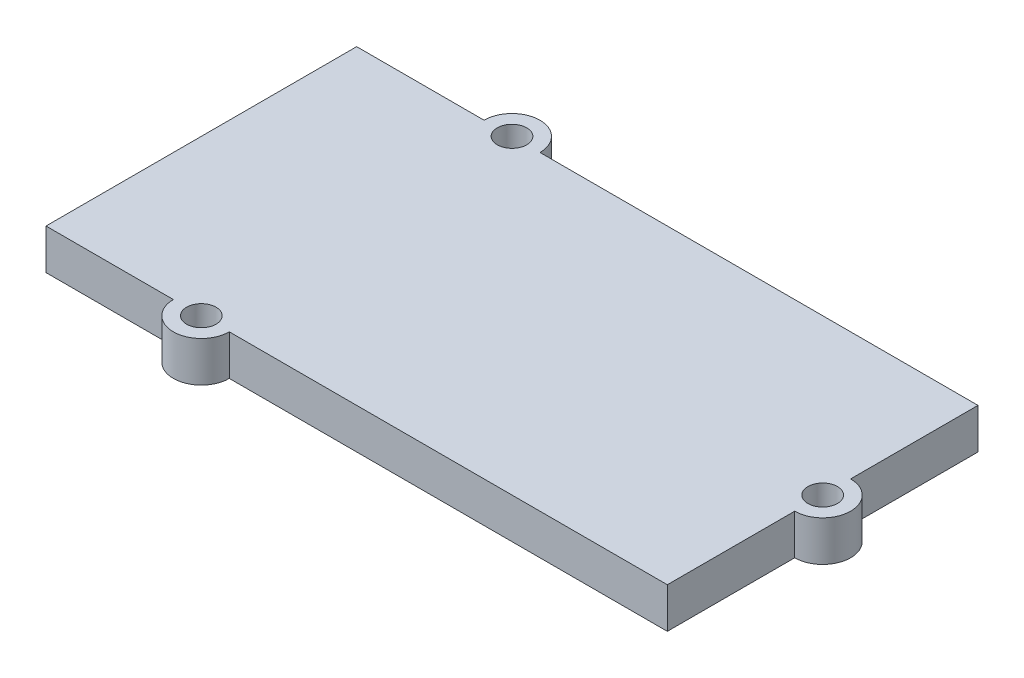
ISO-10303-21;
HEADER;
FILE_DESCRIPTION(('STEP AP214'),'2;1');
FILE_NAME('part.step','',(''),(''),'','','');
FILE_SCHEMA(('AUTOMOTIVE_DESIGN { 1 0 10303 214 1 1 1 1 }'));
ENDSEC;
DATA;
#1=APPLICATION_CONTEXT('core data for automotive mechanical design processes');
#2=APPLICATION_PROTOCOL_DEFINITION('international standard','automotive_design',2000,#1);
#3=PRODUCT_CONTEXT('',#1,'mechanical');
#4=PRODUCT('Part','Part','',(#3));
#5=PRODUCT_RELATED_PRODUCT_CATEGORY('part','',(#4));
#6=PRODUCT_DEFINITION_FORMATION('','',#4);
#7=PRODUCT_DEFINITION_CONTEXT('part definition',#1,'design');
#8=PRODUCT_DEFINITION('design','',#6,#7);
#9=PRODUCT_DEFINITION_SHAPE('','',#8);
#10=(LENGTH_UNIT() NAMED_UNIT(*) SI_UNIT(.MILLI.,.METRE.));
#11=(NAMED_UNIT(*) PLANE_ANGLE_UNIT() SI_UNIT($,.RADIAN.));
#12=(NAMED_UNIT(*) SI_UNIT($,.STERADIAN.) SOLID_ANGLE_UNIT());
#13=UNCERTAINTY_MEASURE_WITH_UNIT(LENGTH_MEASURE(1.E-05),#10,'distance_accuracy_value','');
#14=(GEOMETRIC_REPRESENTATION_CONTEXT(3) GLOBAL_UNCERTAINTY_ASSIGNED_CONTEXT((#13)) GLOBAL_UNIT_ASSIGNED_CONTEXT((#10,
#11,#12)) REPRESENTATION_CONTEXT('',''));
#15=CARTESIAN_POINT('',(0.,0.,0.));
#16=DIRECTION('',(0.,0.,1.));
#17=DIRECTION('',(1.,0.,0.));
#18=AXIS2_PLACEMENT_3D('',#15,#16,#17);
#19=CARTESIAN_POINT('',(-10.,2.6,0.));
#20=DIRECTION('',(0.,-1.,0.));
#21=DIRECTION('',(0.,0.,-1.));
#22=AXIS2_PLACEMENT_3D('',#19,#20,#21);
#23=CYLINDRICAL_SURFACE('',#22,1.8);
#24=CARTESIAN_POINT('',(-10.,0.,0.));
#25=DIRECTION('',(0.,1.,0.));
#26=DIRECTION('',(0.,0.,1.));
#27=AXIS2_PLACEMENT_3D('',#24,#25,#26);
#28=CIRCLE('',#27,1.8);
#29=CARTESIAN_POINT('',(-8.2,0.,0.));
#30=VERTEX_POINT('',#29);
#31=CARTESIAN_POINT('',(-11.8,0.,0.));
#32=VERTEX_POINT('',#31);
#33=EDGE_CURVE('E170',#30,#32,#28,.T.);
#34=ORIENTED_EDGE('',*,*,#33,.T.);
#35=DIRECTION('',(0.,-1.,0.));
#36=VECTOR('',#35,1.);
#37=CARTESIAN_POINT('',(-11.8,2.6,0.));
#38=LINE('',#37,#36);
#39=CARTESIAN_POINT('',(-11.8,2.6,0.));
#40=VERTEX_POINT('',#39);
#41=EDGE_CURVE('E11',#40,#32,#38,.T.);
#42=ORIENTED_EDGE('',*,*,#41,.F.);
#43=CARTESIAN_POINT('',(-10.,2.6,0.));
#44=DIRECTION('',(0.,1.,0.));
#45=DIRECTION('',(0.,0.,1.));
#46=AXIS2_PLACEMENT_3D('',#43,#44,#45);
#47=CIRCLE('',#46,1.8);
#48=CARTESIAN_POINT('',(-8.2,2.6,0.));
#49=VERTEX_POINT('',#48);
#50=EDGE_CURVE('E211',#49,#40,#47,.T.);
#51=ORIENTED_EDGE('',*,*,#50,.F.);
#52=DIRECTION('',(0.,-1.,0.));
#53=VECTOR('',#52,1.);
#54=CARTESIAN_POINT('',(-8.2,2.6,0.));
#55=LINE('',#54,#53);
#56=EDGE_CURVE('E169',#49,#30,#55,.T.);
#57=ORIENTED_EDGE('',*,*,#56,.T.);
#58=EDGE_LOOP('',(#34,#42,#51,#57));
#59=FACE_BOUND('',#58,.T.);
#60=ADVANCED_FACE('F45',(#59),#23,.T.);
#61=CARTESIAN_POINT('',(0.,2.6,0.));
#62=DIRECTION('',(0.,0.,1.));
#63=DIRECTION('',(1.,0.,0.));
#64=AXIS2_PLACEMENT_3D('',#61,#62,#63);
#65=PLANE('',#64);
#66=DIRECTION('',(-1.,0.,0.));
#67=VECTOR('',#66,1.);
#68=CARTESIAN_POINT('',(0.,0.,0.));
#69=LINE('',#68,#67);
#70=CARTESIAN_POINT('',(-20.,0.,0.));
#71=VERTEX_POINT('',#70);
#72=EDGE_CURVE('E174',#32,#71,#69,.T.);
#73=ORIENTED_EDGE('',*,*,#72,.T.);
#74=DIRECTION('',(0.,-1.,0.));
#75=VECTOR('',#74,1.);
#76=CARTESIAN_POINT('',(-20.,2.6,0.));
#77=LINE('',#76,#75);
#78=CARTESIAN_POINT('',(-20.,2.6,0.));
#79=VERTEX_POINT('',#78);
#80=EDGE_CURVE('E54',#79,#71,#77,.T.);
#81=ORIENTED_EDGE('',*,*,#80,.F.);
#82=DIRECTION('',(-1.,0.,0.));
#83=VECTOR('',#82,1.);
#84=CARTESIAN_POINT('',(0.,2.6,0.));
#85=LINE('',#84,#83);
#86=EDGE_CURVE('E107',#40,#79,#85,.T.);
#87=ORIENTED_EDGE('',*,*,#86,.F.);
#88=ORIENTED_EDGE('',*,*,#41,.T.);
#89=EDGE_LOOP('',(#73,#81,#87,#88));
#90=FACE_BOUND('',#89,.T.);
#91=ADVANCED_FACE('F280',(#90),#65,.F.);
#92=CARTESIAN_POINT('',(-20.,2.6,0.));
#93=DIRECTION('',(1.,0.,0.));
#94=DIRECTION('',(0.,0.,-1.));
#95=AXIS2_PLACEMENT_3D('',#92,#93,#94);
#96=PLANE('',#95);
#97=DIRECTION('',(0.,0.,1.));
#98=VECTOR('',#97,1.);
#99=CARTESIAN_POINT('',(-20.,0.,0.));
#100=LINE('',#99,#98);
#101=CARTESIAN_POINT('',(-20.,0.,20.));
#102=VERTEX_POINT('',#101);
#103=EDGE_CURVE('E177',#71,#102,#100,.T.);
#104=ORIENTED_EDGE('',*,*,#103,.T.);
#105=DIRECTION('',(0.,-1.,0.));
#106=VECTOR('',#105,1.);
#107=CARTESIAN_POINT('',(-20.,2.6,20.));
#108=LINE('',#107,#106);
#109=CARTESIAN_POINT('',(-20.,2.6,20.));
#110=VERTEX_POINT('',#109);
#111=EDGE_CURVE('E227',#110,#102,#108,.T.);
#112=ORIENTED_EDGE('',*,*,#111,.F.);
#113=DIRECTION('',(0.,0.,1.));
#114=VECTOR('',#113,1.);
#115=CARTESIAN_POINT('',(-20.,2.6,0.));
#116=LINE('',#115,#114);
#117=EDGE_CURVE('E236',#79,#110,#116,.T.);
#118=ORIENTED_EDGE('',*,*,#117,.F.);
#119=ORIENTED_EDGE('',*,*,#80,.T.);
#120=EDGE_LOOP('',(#104,#112,#118,#119));
#121=FACE_BOUND('',#120,.T.);
#122=ADVANCED_FACE('F234',(#121),#96,.F.);
#123=CARTESIAN_POINT('',(0.,2.6,20.));
#124=DIRECTION('',(0.,0.,1.));
#125=DIRECTION('',(1.,0.,0.));
#126=AXIS2_PLACEMENT_3D('',#123,#124,#125);
#127=PLANE('',#126);
#128=DIRECTION('',(-1.,0.,0.));
#129=VECTOR('',#128,1.);
#130=CARTESIAN_POINT('',(0.,0.,20.));
#131=LINE('',#130,#129);
#132=CARTESIAN_POINT('',(-11.8,0.,20.));
#133=VERTEX_POINT('',#132);
#134=EDGE_CURVE('E181',#133,#102,#131,.T.);
#135=ORIENTED_EDGE('',*,*,#134,.F.);
#136=DIRECTION('',(0.,-1.,0.));
#137=VECTOR('',#136,1.);
#138=CARTESIAN_POINT('',(-11.8,2.6,20.));
#139=LINE('',#138,#137);
#140=CARTESIAN_POINT('',(-11.8,2.6,20.));
#141=VERTEX_POINT('',#140);
#142=EDGE_CURVE('E224',#141,#133,#139,.T.);
#143=ORIENTED_EDGE('',*,*,#142,.F.);
#144=DIRECTION('',(-1.,0.,0.));
#145=VECTOR('',#144,1.);
#146=CARTESIAN_POINT('',(0.,2.6,20.));
#147=LINE('',#146,#145);
#148=EDGE_CURVE('E248',#141,#110,#147,.T.);
#149=ORIENTED_EDGE('',*,*,#148,.T.);
#150=ORIENTED_EDGE('',*,*,#111,.T.);
#151=EDGE_LOOP('',(#135,#143,#149,#150));
#152=FACE_BOUND('',#151,.T.);
#153=ADVANCED_FACE('F245',(#152),#127,.T.);
#154=CARTESIAN_POINT('',(-9.99999999999999,2.6,20.));
#155=DIRECTION('',(0.,-1.,0.));
#156=DIRECTION('',(0.,0.,-1.));
#157=AXIS2_PLACEMENT_3D('',#154,#155,#156);
#158=CYLINDRICAL_SURFACE('',#157,1.8);
#159=CARTESIAN_POINT('',(-9.99999999999999,0.,20.));
#160=DIRECTION('',(0.,1.,0.));
#161=DIRECTION('',(0.,0.,1.));
#162=AXIS2_PLACEMENT_3D('',#159,#160,#161);
#163=CIRCLE('',#162,1.8);
#164=CARTESIAN_POINT('',(-8.19999999999999,0.,20.));
#165=VERTEX_POINT('',#164);
#166=EDGE_CURVE('E185',#165,#133,#163,.F.);
#167=ORIENTED_EDGE('',*,*,#166,.F.);
#168=DIRECTION('',(0.,-1.,0.));
#169=VECTOR('',#168,1.);
#170=CARTESIAN_POINT('',(-8.19999999999999,2.6,20.));
#171=LINE('',#170,#169);
#172=CARTESIAN_POINT('',(-8.19999999999999,2.6,20.));
#173=VERTEX_POINT('',#172);
#174=EDGE_CURVE('E221',#173,#165,#171,.T.);
#175=ORIENTED_EDGE('',*,*,#174,.F.);
#176=CARTESIAN_POINT('',(-9.99999999999999,2.6,20.));
#177=DIRECTION('',(0.,1.,0.));
#178=DIRECTION('',(0.,0.,1.));
#179=AXIS2_PLACEMENT_3D('',#176,#177,#178);
#180=CIRCLE('',#179,1.8);
#181=EDGE_CURVE('E252',#173,#141,#180,.F.);
#182=ORIENTED_EDGE('',*,*,#181,.T.);
#183=ORIENTED_EDGE('',*,*,#142,.T.);
#184=EDGE_LOOP('',(#167,#175,#182,#183));
#185=FACE_BOUND('',#184,.T.);
#186=ADVANCED_FACE('F271',(#185),#158,.T.);
#187=CARTESIAN_POINT('',(20.,0.,20.));
#188=VERTEX_POINT('',#187);
#189=EDGE_CURVE('E186',#188,#165,#131,.T.);
#190=ORIENTED_EDGE('',*,*,#189,.F.);
#191=DIRECTION('',(0.,-1.,0.));
#192=VECTOR('',#191,1.);
#193=CARTESIAN_POINT('',(20.,2.6,20.));
#194=LINE('',#193,#192);
#195=CARTESIAN_POINT('',(20.,2.6,20.));
#196=VERTEX_POINT('',#195);
#197=EDGE_CURVE('E218',#196,#188,#194,.T.);
#198=ORIENTED_EDGE('',*,*,#197,.F.);
#199=EDGE_CURVE('E254',#196,#173,#147,.T.);
#200=ORIENTED_EDGE('',*,*,#199,.T.);
#201=ORIENTED_EDGE('',*,*,#174,.T.);
#202=EDGE_LOOP('',(#190,#198,#200,#201));
#203=FACE_BOUND('',#202,.T.);
#204=ADVANCED_FACE('F269',(#203),#127,.T.);
#205=CARTESIAN_POINT('',(20.,2.6,0.));
#206=DIRECTION('',(1.,0.,0.));
#207=DIRECTION('',(0.,0.,-1.));
#208=AXIS2_PLACEMENT_3D('',#205,#206,#207);
#209=PLANE('',#208);
#210=DIRECTION('',(0.,0.,1.));
#211=VECTOR('',#210,1.);
#212=CARTESIAN_POINT('',(20.,0.,0.));
#213=LINE('',#212,#211);
#214=CARTESIAN_POINT('',(20.,0.,11.8));
#215=VERTEX_POINT('',#214);
#216=EDGE_CURVE('E190',#215,#188,#213,.T.);
#217=ORIENTED_EDGE('',*,*,#216,.F.);
#218=DIRECTION('',(0.,-1.,0.));
#219=VECTOR('',#218,1.);
#220=CARTESIAN_POINT('',(20.,2.6,11.8));
#221=LINE('',#220,#219);
#222=CARTESIAN_POINT('',(20.,2.6,11.8));
#223=VERTEX_POINT('',#222);
#224=EDGE_CURVE('E148',#223,#215,#221,.T.);
#225=ORIENTED_EDGE('',*,*,#224,.F.);
#226=DIRECTION('',(0.,0.,1.));
#227=VECTOR('',#226,1.);
#228=CARTESIAN_POINT('',(20.,2.6,0.));
#229=LINE('',#228,#227);
#230=EDGE_CURVE('E135',#223,#196,#229,.T.);
#231=ORIENTED_EDGE('',*,*,#230,.T.);
#232=ORIENTED_EDGE('',*,*,#197,.T.);
#233=EDGE_LOOP('',(#217,#225,#231,#232));
#234=FACE_BOUND('',#233,.T.);
#235=ADVANCED_FACE('F265',(#234),#209,.T.);
#236=CARTESIAN_POINT('',(20.,2.6,9.99999999999999));
#237=DIRECTION('',(0.,-1.,0.));
#238=DIRECTION('',(0.,0.,-1.));
#239=AXIS2_PLACEMENT_3D('',#236,#237,#238);
#240=CYLINDRICAL_SURFACE('',#239,1.8);
#241=CARTESIAN_POINT('',(20.,0.,9.99999999999999));
#242=DIRECTION('',(0.,1.,0.));
#243=DIRECTION('',(0.,0.,1.));
#244=AXIS2_PLACEMENT_3D('',#241,#242,#243);
#245=CIRCLE('',#244,1.8);
#246=CARTESIAN_POINT('',(20.,0.,8.19999999999999));
#247=VERTEX_POINT('',#246);
#248=EDGE_CURVE('E143',#215,#247,#245,.T.);
#249=ORIENTED_EDGE('',*,*,#248,.T.);
#250=DIRECTION('',(0.,-1.,0.));
#251=VECTOR('',#250,1.);
#252=CARTESIAN_POINT('',(20.,2.6,8.19999999999999));
#253=LINE('',#252,#251);
#254=CARTESIAN_POINT('',(20.,2.6,8.19999999999999));
#255=VERTEX_POINT('',#254);
#256=EDGE_CURVE('E140',#255,#247,#253,.T.);
#257=ORIENTED_EDGE('',*,*,#256,.F.);
#258=CARTESIAN_POINT('',(20.,2.6,9.99999999999999));
#259=DIRECTION('',(0.,1.,0.));
#260=DIRECTION('',(0.,0.,1.));
#261=AXIS2_PLACEMENT_3D('',#258,#259,#260);
#262=CIRCLE('',#261,1.8);
#263=EDGE_CURVE('E127',#223,#255,#262,.T.);
#264=ORIENTED_EDGE('',*,*,#263,.F.);
#265=ORIENTED_EDGE('',*,*,#224,.T.);
#266=EDGE_LOOP('',(#249,#257,#264,#265));
#267=FACE_BOUND('',#266,.T.);
#268=ADVANCED_FACE('F141',(#267),#240,.T.);
#269=CARTESIAN_POINT('',(20.,2.6,0.));
#270=DIRECTION('',(1.,0.,0.));
#271=DIRECTION('',(0.,0.,-1.));
#272=AXIS2_PLACEMENT_3D('',#269,#270,#271);
#273=PLANE('',#272);
#274=DIRECTION('',(0.,0.,1.));
#275=VECTOR('',#274,1.);
#276=CARTESIAN_POINT('',(20.,0.,0.));
#277=LINE('',#276,#275);
#278=CARTESIAN_POINT('',(20.,0.,0.));
#279=VERTEX_POINT('',#278);
#280=EDGE_CURVE('E196',#279,#247,#277,.T.);
#281=ORIENTED_EDGE('',*,*,#280,.F.);
#282=DIRECTION('',(0.,-1.,0.));
#283=VECTOR('',#282,1.);
#284=CARTESIAN_POINT('',(20.,2.6,0.));
#285=LINE('',#284,#283);
#286=CARTESIAN_POINT('',(20.,2.6,0.));
#287=VERTEX_POINT('',#286);
#288=EDGE_CURVE('E96',#287,#279,#285,.T.);
#289=ORIENTED_EDGE('',*,*,#288,.F.);
#290=DIRECTION('',(0.,0.,1.));
#291=VECTOR('',#290,1.);
#292=CARTESIAN_POINT('',(20.,2.6,0.));
#293=LINE('',#292,#291);
#294=EDGE_CURVE('E132',#287,#255,#293,.T.);
#295=ORIENTED_EDGE('',*,*,#294,.T.);
#296=ORIENTED_EDGE('',*,*,#256,.T.);
#297=EDGE_LOOP('',(#281,#289,#295,#296));
#298=FACE_BOUND('',#297,.T.);
#299=ADVANCED_FACE('F150',(#298),#273,.T.);
#300=CARTESIAN_POINT('',(-10.,2.6,0.));
#301=DIRECTION('',(0.,-1.,0.));
#302=DIRECTION('',(0.,0.,-1.));
#303=AXIS2_PLACEMENT_3D('',#300,#301,#302);
#304=CYLINDRICAL_SURFACE('',#303,0.949999999999999);
#305=CARTESIAN_POINT('',(-10.,2.6,0.));
#306=DIRECTION('',(0.,1.,0.));
#307=DIRECTION('',(0.,0.,1.));
#308=AXIS2_PLACEMENT_3D('',#305,#306,#307);
#309=CIRCLE('',#308,0.949999999999999);
#310=CARTESIAN_POINT('',(-10.,2.6,0.950000000000003));
#311=VERTEX_POINT('',#310);
#312=EDGE_CURVE('E161',#311,#311,#309,.T.);
#313=ORIENTED_EDGE('',*,*,#312,.T.);
#314=EDGE_LOOP('',(#313));
#315=FACE_BOUND('',#314,.T.);
#316=CARTESIAN_POINT('',(-10.,0.,0.));
#317=DIRECTION('',(0.,1.,0.));
#318=DIRECTION('',(0.,0.,1.));
#319=AXIS2_PLACEMENT_3D('',#316,#317,#318);
#320=CIRCLE('',#319,0.949999999999999);
#321=CARTESIAN_POINT('',(-10.,0.,0.950000000000003));
#322=VERTEX_POINT('',#321);
#323=EDGE_CURVE('E203',#322,#322,#320,.T.);
#324=ORIENTED_EDGE('',*,*,#323,.F.);
#325=EDGE_LOOP('',(#324));
#326=FACE_BOUND('',#325,.T.);
#327=ADVANCED_FACE('F298',(#315,#326),#304,.F.);
#328=CARTESIAN_POINT('',(20.,2.6,9.99999999999999));
#329=DIRECTION('',(0.,-1.,0.));
#330=DIRECTION('',(0.,0.,-1.));
#331=AXIS2_PLACEMENT_3D('',#328,#329,#330);
#332=CYLINDRICAL_SURFACE('',#331,0.950000000000001);
#333=CARTESIAN_POINT('',(20.,2.6,9.99999999999999));
#334=DIRECTION('',(0.,1.,0.));
#335=DIRECTION('',(0.,0.,1.));
#336=AXIS2_PLACEMENT_3D('',#333,#334,#335);
#337=CIRCLE('',#336,0.950000000000001);
#338=CARTESIAN_POINT('',(20.,2.6,10.95));
#339=VERTEX_POINT('',#338);
#340=EDGE_CURVE('E154',#339,#339,#337,.T.);
#341=ORIENTED_EDGE('',*,*,#340,.T.);
#342=EDGE_LOOP('',(#341));
#343=FACE_BOUND('',#342,.T.);
#344=CARTESIAN_POINT('',(20.,0.,9.99999999999999));
#345=DIRECTION('',(0.,1.,0.));
#346=DIRECTION('',(0.,0.,1.));
#347=AXIS2_PLACEMENT_3D('',#344,#345,#346);
#348=CIRCLE('',#347,0.950000000000001);
#349=CARTESIAN_POINT('',(20.,0.,10.95));
#350=VERTEX_POINT('',#349);
#351=EDGE_CURVE('E199',#350,#350,#348,.T.);
#352=ORIENTED_EDGE('',*,*,#351,.F.);
#353=EDGE_LOOP('',(#352));
#354=FACE_BOUND('',#353,.T.);
#355=ADVANCED_FACE('F291',(#343,#354),#332,.F.);
#356=EDGE_CURVE('E99',#279,#30,#69,.T.);
#357=ORIENTED_EDGE('',*,*,#356,.T.);
#358=ORIENTED_EDGE('',*,*,#56,.F.);
#359=EDGE_CURVE('E62',#287,#49,#85,.T.);
#360=ORIENTED_EDGE('',*,*,#359,.F.);
#361=ORIENTED_EDGE('',*,*,#288,.T.);
#362=EDGE_LOOP('',(#357,#358,#360,#361));
#363=FACE_BOUND('',#362,.T.);
#364=ADVANCED_FACE('F286',(#363),#65,.F.);
#365=CARTESIAN_POINT('',(-9.99999999999999,2.6,20.));
#366=DIRECTION('',(0.,-1.,0.));
#367=DIRECTION('',(0.,0.,-1.));
#368=AXIS2_PLACEMENT_3D('',#365,#366,#367);
#369=CYLINDRICAL_SURFACE('',#368,0.949999999999999);
#370=CARTESIAN_POINT('',(-9.99999999999999,2.6,20.));
#371=DIRECTION('',(0.,1.,0.));
#372=DIRECTION('',(0.,0.,1.));
#373=AXIS2_PLACEMENT_3D('',#370,#371,#372);
#374=CIRCLE('',#373,0.949999999999999);
#375=CARTESIAN_POINT('',(-9.99999999999999,2.6,20.95));
#376=VERTEX_POINT('',#375);
#377=EDGE_CURVE('E165',#376,#376,#374,.F.);
#378=ORIENTED_EDGE('',*,*,#377,.F.);
#379=EDGE_LOOP('',(#378));
#380=FACE_BOUND('',#379,.T.);
#381=CARTESIAN_POINT('',(-9.99999999999999,0.,20.));
#382=DIRECTION('',(0.,1.,0.));
#383=DIRECTION('',(0.,0.,1.));
#384=AXIS2_PLACEMENT_3D('',#381,#382,#383);
#385=CIRCLE('',#384,0.949999999999999);
#386=CARTESIAN_POINT('',(-9.99999999999999,0.,20.95));
#387=VERTEX_POINT('',#386);
#388=EDGE_CURVE('E207',#387,#387,#385,.F.);
#389=ORIENTED_EDGE('',*,*,#388,.T.);
#390=EDGE_LOOP('',(#389));
#391=FACE_BOUND('',#390,.T.);
#392=ADVANCED_FACE('F290',(#380,#391),#369,.F.);
#393=CARTESIAN_POINT('',(0.,2.6,0.));
#394=DIRECTION('',(0.,1.,0.));
#395=DIRECTION('',(0.,0.,1.));
#396=AXIS2_PLACEMENT_3D('',#393,#394,#395);
#397=PLANE('',#396);
#398=ORIENTED_EDGE('',*,*,#50,.T.);
#399=ORIENTED_EDGE('',*,*,#86,.T.);
#400=ORIENTED_EDGE('',*,*,#117,.T.);
#401=ORIENTED_EDGE('',*,*,#148,.F.);
#402=ORIENTED_EDGE('',*,*,#181,.F.);
#403=ORIENTED_EDGE('',*,*,#199,.F.);
#404=ORIENTED_EDGE('',*,*,#230,.F.);
#405=ORIENTED_EDGE('',*,*,#263,.T.);
#406=ORIENTED_EDGE('',*,*,#294,.F.);
#407=ORIENTED_EDGE('',*,*,#359,.T.);
#408=EDGE_LOOP('',(#398,#399,#400,#401,#402,#403,#404,#405,#406,#407));
#409=FACE_BOUND('',#408,.T.);
#410=ORIENTED_EDGE('',*,*,#340,.F.);
#411=EDGE_LOOP('',(#410));
#412=FACE_BOUND('',#411,.T.);
#413=ORIENTED_EDGE('',*,*,#312,.F.);
#414=EDGE_LOOP('',(#413));
#415=FACE_BOUND('',#414,.T.);
#416=ORIENTED_EDGE('',*,*,#377,.T.);
#417=EDGE_LOOP('',(#416));
#418=FACE_BOUND('',#417,.T.);
#419=ADVANCED_FACE('F129',(#409,#412,#415,#418),#397,.T.);
#420=CARTESIAN_POINT('',(0.,0.,0.));
#421=DIRECTION('',(0.,1.,0.));
#422=DIRECTION('',(0.,0.,1.));
#423=AXIS2_PLACEMENT_3D('',#420,#421,#422);
#424=PLANE('',#423);
#425=ORIENTED_EDGE('',*,*,#33,.F.);
#426=ORIENTED_EDGE('',*,*,#356,.F.);
#427=ORIENTED_EDGE('',*,*,#280,.T.);
#428=ORIENTED_EDGE('',*,*,#248,.F.);
#429=ORIENTED_EDGE('',*,*,#216,.T.);
#430=ORIENTED_EDGE('',*,*,#189,.T.);
#431=ORIENTED_EDGE('',*,*,#166,.T.);
#432=ORIENTED_EDGE('',*,*,#134,.T.);
#433=ORIENTED_EDGE('',*,*,#103,.F.);
#434=ORIENTED_EDGE('',*,*,#72,.F.);
#435=EDGE_LOOP('',(#425,#426,#427,#428,#429,#430,#431,#432,#433,#434));
#436=FACE_BOUND('',#435,.T.);
#437=ORIENTED_EDGE('',*,*,#351,.T.);
#438=EDGE_LOOP('',(#437));
#439=FACE_BOUND('',#438,.T.);
#440=ORIENTED_EDGE('',*,*,#323,.T.);
#441=EDGE_LOOP('',(#440));
#442=FACE_BOUND('',#441,.T.);
#443=ORIENTED_EDGE('',*,*,#388,.F.);
#444=EDGE_LOOP('',(#443));
#445=FACE_BOUND('',#444,.T.);
#446=ADVANCED_FACE('F239',(#436,#439,#442,#445),#424,.F.);
#447=CLOSED_SHELL('',(#60,#91,#122,#153,#186,#204,#235,#268,#299,#327,#355,#364,#392,#419,#446));
#448=MANIFOLD_SOLID_BREP('B2',#447);
#449=ADVANCED_BREP_SHAPE_REPRESENTATION('',(#18,#448),#14);
#450=SHAPE_DEFINITION_REPRESENTATION(#9,#449);
ENDSEC;
END-ISO-10303-21;
